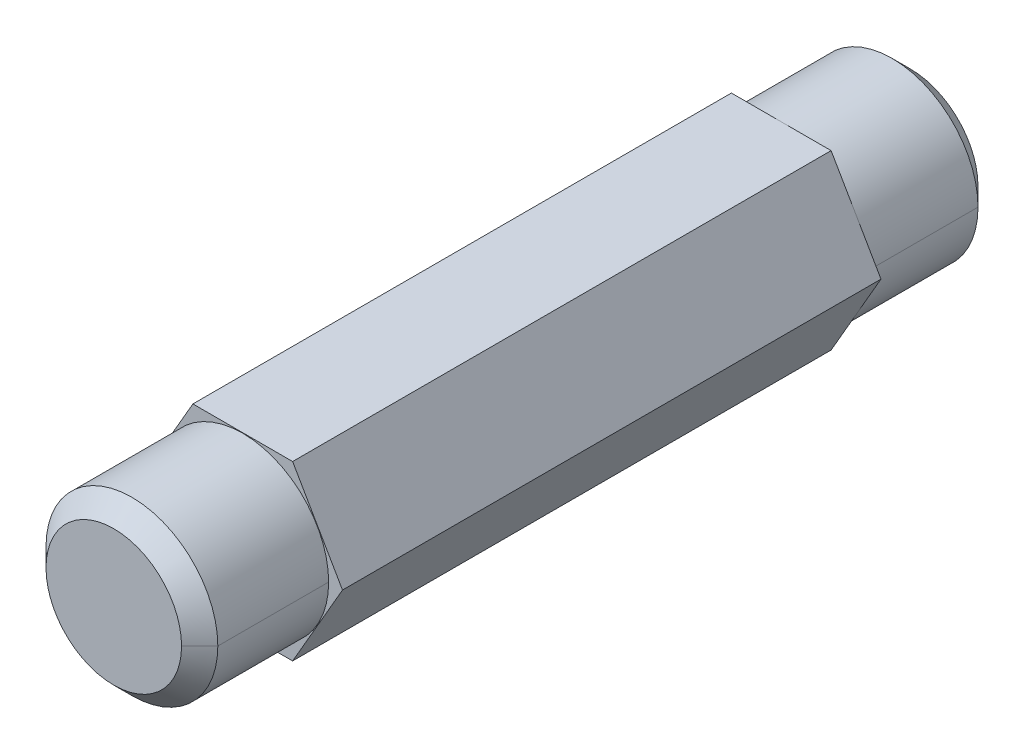
ISO-10303-21;
HEADER;
FILE_DESCRIPTION(('STEP AP214'),'2;1');
FILE_NAME('part.step','',(''),(''),'','','');
FILE_SCHEMA(('AUTOMOTIVE_DESIGN { 1 0 10303 214 1 1 1 1 }'));
ENDSEC;
DATA;
#1=APPLICATION_CONTEXT('core data for automotive mechanical design processes');
#2=APPLICATION_PROTOCOL_DEFINITION('international standard','automotive_design',2000,#1);
#3=PRODUCT_CONTEXT('',#1,'mechanical');
#4=PRODUCT('Part','Part','',(#3));
#5=PRODUCT_RELATED_PRODUCT_CATEGORY('part','',(#4));
#6=PRODUCT_DEFINITION_FORMATION('','',#4);
#7=PRODUCT_DEFINITION_CONTEXT('part definition',#1,'design');
#8=PRODUCT_DEFINITION('design','',#6,#7);
#9=PRODUCT_DEFINITION_SHAPE('','',#8);
#10=(LENGTH_UNIT() NAMED_UNIT(*) SI_UNIT(.MILLI.,.METRE.));
#11=(NAMED_UNIT(*) PLANE_ANGLE_UNIT() SI_UNIT($,.RADIAN.));
#12=(NAMED_UNIT(*) SI_UNIT($,.STERADIAN.) SOLID_ANGLE_UNIT());
#13=UNCERTAINTY_MEASURE_WITH_UNIT(LENGTH_MEASURE(1.E-05),#10,'distance_accuracy_value','');
#14=(GEOMETRIC_REPRESENTATION_CONTEXT(3) GLOBAL_UNCERTAINTY_ASSIGNED_CONTEXT((#13)) GLOBAL_UNIT_ASSIGNED_CONTEXT((#10,
#11,#12)) REPRESENTATION_CONTEXT('',''));
#15=CARTESIAN_POINT('',(0.,0.,0.));
#16=DIRECTION('',(0.,0.,1.));
#17=DIRECTION('',(1.,0.,0.));
#18=AXIS2_PLACEMENT_3D('',#15,#16,#17);
#19=CARTESIAN_POINT('',(0.,0.,21.9583));
#20=DIRECTION('',(0.,0.,-1.));
#21=DIRECTION('',(-1.,0.,0.));
#22=AXIS2_PLACEMENT_3D('',#19,#20,#21);
#23=CONICAL_SURFACE('',#22,3.7371,0.785398163397445);
#24=CARTESIAN_POINT('',(0.,0.,21.9583));
#25=DIRECTION('',(0.,0.,1.));
#26=DIRECTION('',(1.,0.,0.));
#27=AXIS2_PLACEMENT_3D('',#24,#25,#26);
#28=CIRCLE('',#27,3.7371);
#29=CARTESIAN_POINT('',(3.7371,0.,21.9583));
#30=VERTEX_POINT('',#29);
#31=CARTESIAN_POINT('',(-3.7371,0.,21.9583));
#32=VERTEX_POINT('',#31);
#33=EDGE_CURVE('E39',#30,#32,#28,.T.);
#34=ORIENTED_EDGE('',*,*,#33,.F.);
#35=DIRECTION('',(0.707106781186545,0.,-0.70710678118655));
#36=VECTOR('',#35,1.);
#37=CARTESIAN_POINT('',(3.7371,0.,21.9583));
#38=LINE('',#37,#36);
#39=CARTESIAN_POINT('',(4.7371,0.,20.9583));
#40=VERTEX_POINT('',#39);
#41=EDGE_CURVE('E11',#30,#40,#38,.T.);
#42=ORIENTED_EDGE('',*,*,#41,.T.);
#43=CARTESIAN_POINT('',(0.,0.,20.9583));
#44=DIRECTION('',(0.,0.,-1.));
#45=DIRECTION('',(1.,0.,0.));
#46=AXIS2_PLACEMENT_3D('',#43,#44,#45);
#47=CIRCLE('',#46,4.7371);
#48=CARTESIAN_POINT('',(-4.7371,0.,20.9583));
#49=VERTEX_POINT('',#48);
#50=EDGE_CURVE('E255',#49,#40,#47,.T.);
#51=ORIENTED_EDGE('',*,*,#50,.F.);
#52=DIRECTION('',(-0.707106781186545,0.,-0.70710678118655));
#53=VECTOR('',#52,1.);
#54=CARTESIAN_POINT('',(-3.7371,0.,21.9583));
#55=LINE('',#54,#53);
#56=EDGE_CURVE('E260',#32,#49,#55,.T.);
#57=ORIENTED_EDGE('',*,*,#56,.F.);
#58=EDGE_LOOP('',(#34,#42,#51,#57));
#59=FACE_BOUND('',#58,.T.);
#60=ADVANCED_FACE('F16',(#59),#23,.T.);
#61=CARTESIAN_POINT('',(0.,0.,-20.9583));
#62=DIRECTION('',(0.,0.,1.));
#63=DIRECTION('',(1.,0.,0.));
#64=AXIS2_PLACEMENT_3D('',#61,#62,#63);
#65=CONICAL_SURFACE('',#64,4.7371,0.785398163397452);
#66=CARTESIAN_POINT('',(0.,0.,-21.9583));
#67=DIRECTION('',(0.,0.,-1.));
#68=DIRECTION('',(-1.,0.,0.));
#69=AXIS2_PLACEMENT_3D('',#66,#67,#68);
#70=CIRCLE('',#69,3.7371);
#71=CARTESIAN_POINT('',(-3.7371,0.,-21.9583));
#72=VERTEX_POINT('',#71);
#73=CARTESIAN_POINT('',(3.7371,0.,-21.9583));
#74=VERTEX_POINT('',#73);
#75=EDGE_CURVE('E210',#72,#74,#70,.T.);
#76=ORIENTED_EDGE('',*,*,#75,.F.);
#77=DIRECTION('',(-0.70710678118655,0.,0.707106781186545));
#78=VECTOR('',#77,1.);
#79=CARTESIAN_POINT('',(-4.7371,0.,-20.9583));
#80=LINE('',#79,#78);
#81=CARTESIAN_POINT('',(-4.7371,0.,-20.9583));
#82=VERTEX_POINT('',#81);
#83=EDGE_CURVE('E26',#72,#82,#80,.T.);
#84=ORIENTED_EDGE('',*,*,#83,.T.);
#85=CARTESIAN_POINT('',(0.,0.,-20.9583));
#86=DIRECTION('',(0.,0.,1.));
#87=DIRECTION('',(-1.,0.,0.));
#88=AXIS2_PLACEMENT_3D('',#85,#86,#87);
#89=CIRCLE('',#88,4.7371);
#90=CARTESIAN_POINT('',(4.7371,0.,-20.9583));
#91=VERTEX_POINT('',#90);
#92=EDGE_CURVE('E166',#91,#82,#89,.T.);
#93=ORIENTED_EDGE('',*,*,#92,.F.);
#94=DIRECTION('',(0.70710678118655,0.,0.707106781186545));
#95=VECTOR('',#94,1.);
#96=CARTESIAN_POINT('',(4.7371,0.,-20.9583));
#97=LINE('',#96,#95);
#98=EDGE_CURVE('E253',#74,#91,#97,.T.);
#99=ORIENTED_EDGE('',*,*,#98,.F.);
#100=EDGE_LOOP('',(#76,#84,#93,#99));
#101=FACE_BOUND('',#100,.T.);
#102=ADVANCED_FACE('F332',(#101),#65,.T.);
#103=CARTESIAN_POINT('',(0.,0.,-21.9583));
#104=DIRECTION('',(0.,0.,1.));
#105=DIRECTION('',(1.,0.,0.));
#106=AXIS2_PLACEMENT_3D('',#103,#104,#105);
#107=CYLINDRICAL_SURFACE('',#106,4.7371);
#108=ORIENTED_EDGE('',*,*,#92,.T.);
#109=DIRECTION('',(0.,0.,1.));
#110=VECTOR('',#109,1.);
#111=CARTESIAN_POINT('',(-4.7371,0.,-21.9583));
#112=LINE('',#111,#110);
#113=CARTESIAN_POINT('',(-4.7371,0.,-14.8463));
#114=VERTEX_POINT('',#113);
#115=EDGE_CURVE('E257',#82,#114,#112,.T.);
#116=ORIENTED_EDGE('',*,*,#115,.T.);
#117=CARTESIAN_POINT('',(0.,0.,-14.8463));
#118=DIRECTION('',(0.,0.,1.));
#119=DIRECTION('',(1.,0.,0.));
#120=AXIS2_PLACEMENT_3D('',#117,#118,#119);
#121=CIRCLE('',#120,4.7371);
#122=CARTESIAN_POINT('',(4.7371,0.,-14.8463));
#123=VERTEX_POINT('',#122);
#124=EDGE_CURVE('E178',#123,#114,#121,.T.);
#125=ORIENTED_EDGE('',*,*,#124,.F.);
#126=DIRECTION('',(0.,0.,1.));
#127=VECTOR('',#126,1.);
#128=CARTESIAN_POINT('',(4.7371,0.,-21.9583));
#129=LINE('',#128,#127);
#130=EDGE_CURVE('E209',#91,#123,#129,.T.);
#131=ORIENTED_EDGE('',*,*,#130,.F.);
#132=EDGE_LOOP('',(#108,#116,#125,#131));
#133=FACE_BOUND('',#132,.T.);
#134=ADVANCED_FACE('F327',(#133),#107,.T.);
#135=CARTESIAN_POINT('',(0.,0.,21.9583));
#136=DIRECTION('',(0.,0.,-1.));
#137=DIRECTION('',(-1.,0.,0.));
#138=AXIS2_PLACEMENT_3D('',#135,#136,#137);
#139=CYLINDRICAL_SURFACE('',#138,4.7371);
#140=ORIENTED_EDGE('',*,*,#50,.T.);
#141=DIRECTION('',(0.,0.,-1.));
#142=VECTOR('',#141,1.);
#143=CARTESIAN_POINT('',(4.7371,0.,21.9583));
#144=LINE('',#143,#142);
#145=CARTESIAN_POINT('',(4.7371,0.,14.8463));
#146=VERTEX_POINT('',#145);
#147=EDGE_CURVE('E148',#40,#146,#144,.T.);
#148=ORIENTED_EDGE('',*,*,#147,.T.);
#149=CARTESIAN_POINT('',(0.,0.,14.8463));
#150=DIRECTION('',(0.,0.,1.));
#151=DIRECTION('',(1.,0.,0.));
#152=AXIS2_PLACEMENT_3D('',#149,#150,#151);
#153=CIRCLE('',#152,4.7371);
#154=CARTESIAN_POINT('',(-4.7371,0.,14.8463));
#155=VERTEX_POINT('',#154);
#156=EDGE_CURVE('E146',#146,#155,#153,.T.);
#157=ORIENTED_EDGE('',*,*,#156,.T.);
#158=DIRECTION('',(0.,0.,-1.));
#159=VECTOR('',#158,1.);
#160=CARTESIAN_POINT('',(-4.7371,0.,21.9583));
#161=LINE('',#160,#159);
#162=EDGE_CURVE('E133',#49,#155,#161,.T.);
#163=ORIENTED_EDGE('',*,*,#162,.F.);
#164=EDGE_LOOP('',(#140,#148,#157,#163));
#165=FACE_BOUND('',#164,.T.);
#166=ADVANCED_FACE('F147',(#165),#139,.T.);
#167=CARTESIAN_POINT('',(5.49926131403118,0.,14.8463));
#168=DIRECTION('',(0.,0.,1.));
#169=DIRECTION('',(1.,0.,0.));
#170=AXIS2_PLACEMENT_3D('',#167,#168,#169);
#171=PLANE('',#170);
#172=DIRECTION('',(0.5,0.866025403784439,0.));
#173=VECTOR('',#172,1.);
#174=CARTESIAN_POINT('',(2.74963065701559,-4.7625,14.8463));
#175=LINE('',#174,#173);
#176=CARTESIAN_POINT('',(2.74963065701559,-4.7625,14.8463));
#177=VERTEX_POINT('',#176);
#178=CARTESIAN_POINT('',(5.49926131403118,0.,14.8463));
#179=VERTEX_POINT('',#178);
#180=EDGE_CURVE('E151',#177,#179,#175,.T.);
#181=ORIENTED_EDGE('',*,*,#180,.T.);
#182=DIRECTION('',(-0.5,0.866025403784439,0.));
#183=VECTOR('',#182,1.);
#184=CARTESIAN_POINT('',(5.49926131403118,0.,14.8463));
#185=LINE('',#184,#183);
#186=CARTESIAN_POINT('',(2.74963065701559,4.7625,14.8463));
#187=VERTEX_POINT('',#186);
#188=EDGE_CURVE('E188',#179,#187,#185,.T.);
#189=ORIENTED_EDGE('',*,*,#188,.T.);
#190=DIRECTION('',(-1.,0.,0.));
#191=VECTOR('',#190,1.);
#192=CARTESIAN_POINT('',(2.74963065701559,4.7625,14.8463));
#193=LINE('',#192,#191);
#194=CARTESIAN_POINT('',(-2.7496306570156,4.7625,14.8463));
#195=VERTEX_POINT('',#194);
#196=EDGE_CURVE('E183',#187,#195,#193,.T.);
#197=ORIENTED_EDGE('',*,*,#196,.T.);
#198=DIRECTION('',(-0.5,-0.866025403784439,0.));
#199=VECTOR('',#198,1.);
#200=CARTESIAN_POINT('',(-2.7496306570156,4.7625,14.8463));
#201=LINE('',#200,#199);
#202=CARTESIAN_POINT('',(-5.49926131403119,0.,14.8463));
#203=VERTEX_POINT('',#202);
#204=EDGE_CURVE('E179',#195,#203,#201,.T.);
#205=ORIENTED_EDGE('',*,*,#204,.T.);
#206=DIRECTION('',(0.5,-0.866025403784439,0.));
#207=VECTOR('',#206,1.);
#208=CARTESIAN_POINT('',(-5.49926131403119,0.,14.8463));
#209=LINE('',#208,#207);
#210=CARTESIAN_POINT('',(-2.7496306570156,-4.7625,14.8463));
#211=VERTEX_POINT('',#210);
#212=EDGE_CURVE('E184',#203,#211,#209,.T.);
#213=ORIENTED_EDGE('',*,*,#212,.T.);
#214=DIRECTION('',(1.,0.,0.));
#215=VECTOR('',#214,1.);
#216=CARTESIAN_POINT('',(-2.7496306570156,-4.7625,14.8463));
#217=LINE('',#216,#215);
#218=EDGE_CURVE('E195',#211,#177,#217,.T.);
#219=ORIENTED_EDGE('',*,*,#218,.T.);
#220=EDGE_LOOP('',(#181,#189,#197,#205,#213,#219));
#221=FACE_BOUND('',#220,.T.);
#222=CARTESIAN_POINT('',(0.,0.,14.8463));
#223=DIRECTION('',(0.,0.,1.));
#224=DIRECTION('',(1.,0.,0.));
#225=AXIS2_PLACEMENT_3D('',#222,#223,#224);
#226=CIRCLE('',#225,4.7371);
#227=EDGE_CURVE('E137',#155,#146,#226,.T.);
#228=ORIENTED_EDGE('',*,*,#227,.F.);
#229=ORIENTED_EDGE('',*,*,#156,.F.);
#230=EDGE_LOOP('',(#228,#229));
#231=FACE_BOUND('',#230,.T.);
#232=ADVANCED_FACE('F153',(#221,#231),#171,.T.);
#233=CARTESIAN_POINT('',(2.74963065701559,-4.7625,14.8463));
#234=DIRECTION('',(-0.866025403784439,0.5,0.));
#235=DIRECTION('',(0.,0.,1.));
#236=AXIS2_PLACEMENT_3D('',#233,#234,#235);
#237=PLANE('',#236);
#238=DIRECTION('',(0.5,0.866025403784439,0.));
#239=VECTOR('',#238,1.);
#240=CARTESIAN_POINT('',(2.74963065701559,-4.7625,-14.8463));
#241=LINE('',#240,#239);
#242=CARTESIAN_POINT('',(2.74963065701559,-4.7625,-14.8463));
#243=VERTEX_POINT('',#242);
#244=CARTESIAN_POINT('',(5.49926131403118,0.,-14.8463));
#245=VERTEX_POINT('',#244);
#246=EDGE_CURVE('E198',#243,#245,#241,.T.);
#247=ORIENTED_EDGE('',*,*,#246,.T.);
#248=DIRECTION('',(0.,0.,-1.));
#249=VECTOR('',#248,1.);
#250=CARTESIAN_POINT('',(5.49926131403118,0.,14.8463));
#251=LINE('',#250,#249);
#252=EDGE_CURVE('E221',#179,#245,#251,.T.);
#253=ORIENTED_EDGE('',*,*,#252,.F.);
#254=ORIENTED_EDGE('',*,*,#180,.F.);
#255=DIRECTION('',(0.,0.,-1.));
#256=VECTOR('',#255,1.);
#257=CARTESIAN_POINT('',(2.74963065701559,-4.7625,14.8463));
#258=LINE('',#257,#256);
#259=EDGE_CURVE('E220',#177,#243,#258,.T.);
#260=ORIENTED_EDGE('',*,*,#259,.T.);
#261=EDGE_LOOP('',(#247,#253,#254,#260));
#262=FACE_BOUND('',#261,.T.);
#263=ADVANCED_FACE('F365',(#262),#237,.F.);
#264=CARTESIAN_POINT('',(5.49926131403118,0.,14.8463));
#265=DIRECTION('',(-0.866025403784439,-0.5,0.));
#266=DIRECTION('',(-0.5,0.866025403784439,0.));
#267=AXIS2_PLACEMENT_3D('',#264,#265,#266);
#268=PLANE('',#267);
#269=DIRECTION('',(-0.5,0.866025403784439,0.));
#270=VECTOR('',#269,1.);
#271=CARTESIAN_POINT('',(5.49926131403118,0.,-14.8463));
#272=LINE('',#271,#270);
#273=CARTESIAN_POINT('',(2.74963065701559,4.7625,-14.8463));
#274=VERTEX_POINT('',#273);
#275=EDGE_CURVE('E216',#245,#274,#272,.T.);
#276=ORIENTED_EDGE('',*,*,#275,.T.);
#277=DIRECTION('',(0.,0.,-1.));
#278=VECTOR('',#277,1.);
#279=CARTESIAN_POINT('',(2.74963065701559,4.7625,14.8463));
#280=LINE('',#279,#278);
#281=EDGE_CURVE('E202',#187,#274,#280,.T.);
#282=ORIENTED_EDGE('',*,*,#281,.F.);
#283=ORIENTED_EDGE('',*,*,#188,.F.);
#284=ORIENTED_EDGE('',*,*,#252,.T.);
#285=EDGE_LOOP('',(#276,#282,#283,#284));
#286=FACE_BOUND('',#285,.T.);
#287=ADVANCED_FACE('F312',(#286),#268,.F.);
#288=CARTESIAN_POINT('',(2.74963065701559,4.7625,14.8463));
#289=DIRECTION('',(0.,-1.,0.));
#290=DIRECTION('',(0.,0.,-1.));
#291=AXIS2_PLACEMENT_3D('',#288,#289,#290);
#292=PLANE('',#291);
#293=DIRECTION('',(-1.,0.,0.));
#294=VECTOR('',#293,1.);
#295=CARTESIAN_POINT('',(2.74963065701559,4.7625,-14.8463));
#296=LINE('',#295,#294);
#297=CARTESIAN_POINT('',(-2.7496306570156,4.7625,-14.8463));
#298=VERTEX_POINT('',#297);
#299=EDGE_CURVE('E230',#274,#298,#296,.T.);
#300=ORIENTED_EDGE('',*,*,#299,.T.);
#301=DIRECTION('',(0.,0.,-1.));
#302=VECTOR('',#301,1.);
#303=CARTESIAN_POINT('',(-2.7496306570156,4.7625,14.8463));
#304=LINE('',#303,#302);
#305=EDGE_CURVE('E170',#195,#298,#304,.T.);
#306=ORIENTED_EDGE('',*,*,#305,.F.);
#307=ORIENTED_EDGE('',*,*,#196,.F.);
#308=ORIENTED_EDGE('',*,*,#281,.T.);
#309=EDGE_LOOP('',(#300,#306,#307,#308));
#310=FACE_BOUND('',#309,.T.);
#311=ADVANCED_FACE('F295',(#310),#292,.F.);
#312=CARTESIAN_POINT('',(-2.7496306570156,4.7625,14.8463));
#313=DIRECTION('',(0.866025403784439,-0.5,0.));
#314=DIRECTION('',(0.,0.,-1.));
#315=AXIS2_PLACEMENT_3D('',#312,#313,#314);
#316=PLANE('',#315);
#317=DIRECTION('',(-0.5,-0.866025403784439,0.));
#318=VECTOR('',#317,1.);
#319=CARTESIAN_POINT('',(-2.7496306570156,4.7625,-14.8463));
#320=LINE('',#319,#318);
#321=CARTESIAN_POINT('',(-5.49926131403119,0.,-14.8463));
#322=VERTEX_POINT('',#321);
#323=EDGE_CURVE('E191',#298,#322,#320,.T.);
#324=ORIENTED_EDGE('',*,*,#323,.T.);
#325=DIRECTION('',(0.,0.,-1.));
#326=VECTOR('',#325,1.);
#327=CARTESIAN_POINT('',(-5.49926131403119,0.,14.8463));
#328=LINE('',#327,#326);
#329=EDGE_CURVE('E171',#203,#322,#328,.T.);
#330=ORIENTED_EDGE('',*,*,#329,.F.);
#331=ORIENTED_EDGE('',*,*,#204,.F.);
#332=ORIENTED_EDGE('',*,*,#305,.T.);
#333=EDGE_LOOP('',(#324,#330,#331,#332));
#334=FACE_BOUND('',#333,.T.);
#335=ADVANCED_FACE('F306',(#334),#316,.F.);
#336=CARTESIAN_POINT('',(-5.49926131403119,0.,14.8463));
#337=DIRECTION('',(0.866025403784439,0.5,0.));
#338=DIRECTION('',(0.,0.,-1.));
#339=AXIS2_PLACEMENT_3D('',#336,#337,#338);
#340=PLANE('',#339);
#341=DIRECTION('',(0.5,-0.866025403784439,0.));
#342=VECTOR('',#341,1.);
#343=CARTESIAN_POINT('',(-5.49926131403119,0.,-14.8463));
#344=LINE('',#343,#342);
#345=CARTESIAN_POINT('',(-2.7496306570156,-4.7625,-14.8463));
#346=VERTEX_POINT('',#345);
#347=EDGE_CURVE('E167',#322,#346,#344,.T.);
#348=ORIENTED_EDGE('',*,*,#347,.T.);
#349=DIRECTION('',(0.,0.,-1.));
#350=VECTOR('',#349,1.);
#351=CARTESIAN_POINT('',(-2.7496306570156,-4.7625,14.8463));
#352=LINE('',#351,#350);
#353=EDGE_CURVE('E194',#211,#346,#352,.T.);
#354=ORIENTED_EDGE('',*,*,#353,.F.);
#355=ORIENTED_EDGE('',*,*,#212,.F.);
#356=ORIENTED_EDGE('',*,*,#329,.T.);
#357=EDGE_LOOP('',(#348,#354,#355,#356));
#358=FACE_BOUND('',#357,.T.);
#359=ADVANCED_FACE('F424',(#358),#340,.F.);
#360=CARTESIAN_POINT('',(-2.7496306570156,-4.7625,14.8463));
#361=DIRECTION('',(0.,1.,0.));
#362=DIRECTION('',(1.,0.,0.));
#363=AXIS2_PLACEMENT_3D('',#360,#361,#362);
#364=PLANE('',#363);
#365=DIRECTION('',(1.,0.,0.));
#366=VECTOR('',#365,1.);
#367=CARTESIAN_POINT('',(-2.7496306570156,-4.7625,-14.8463));
#368=LINE('',#367,#366);
#369=EDGE_CURVE('E19',#346,#243,#368,.T.);
#370=ORIENTED_EDGE('',*,*,#369,.T.);
#371=ORIENTED_EDGE('',*,*,#259,.F.);
#372=ORIENTED_EDGE('',*,*,#218,.F.);
#373=ORIENTED_EDGE('',*,*,#353,.T.);
#374=EDGE_LOOP('',(#370,#371,#372,#373));
#375=FACE_BOUND('',#374,.T.);
#376=ADVANCED_FACE('F317',(#375),#364,.F.);
#377=CARTESIAN_POINT('',(5.49926131403118,0.,-14.8463));
#378=DIRECTION('',(0.,0.,1.));
#379=DIRECTION('',(1.,0.,0.));
#380=AXIS2_PLACEMENT_3D('',#377,#378,#379);
#381=PLANE('',#380);
#382=ORIENTED_EDGE('',*,*,#246,.F.);
#383=ORIENTED_EDGE('',*,*,#369,.F.);
#384=ORIENTED_EDGE('',*,*,#347,.F.);
#385=ORIENTED_EDGE('',*,*,#323,.F.);
#386=ORIENTED_EDGE('',*,*,#299,.F.);
#387=ORIENTED_EDGE('',*,*,#275,.F.);
#388=EDGE_LOOP('',(#382,#383,#384,#385,#386,#387));
#389=FACE_BOUND('',#388,.T.);
#390=ORIENTED_EDGE('',*,*,#124,.T.);
#391=CARTESIAN_POINT('',(0.,0.,-14.8463));
#392=DIRECTION('',(0.,0.,1.));
#393=DIRECTION('',(1.,0.,0.));
#394=AXIS2_PLACEMENT_3D('',#391,#392,#393);
#395=CIRCLE('',#394,4.7371);
#396=EDGE_CURVE('E173',#114,#123,#395,.T.);
#397=ORIENTED_EDGE('',*,*,#396,.T.);
#398=EDGE_LOOP('',(#390,#397));
#399=FACE_BOUND('',#398,.T.);
#400=ADVANCED_FACE('F301',(#389,#399),#381,.F.);
#401=CARTESIAN_POINT('',(0.,0.,21.9583));
#402=DIRECTION('',(0.,0.,-1.));
#403=DIRECTION('',(-1.,0.,0.));
#404=AXIS2_PLACEMENT_3D('',#401,#402,#403);
#405=CYLINDRICAL_SURFACE('',#404,4.7371);
#406=ORIENTED_EDGE('',*,*,#147,.F.);
#407=CARTESIAN_POINT('',(0.,0.,20.9583));
#408=DIRECTION('',(0.,0.,-1.));
#409=DIRECTION('',(1.,0.,0.));
#410=AXIS2_PLACEMENT_3D('',#407,#408,#409);
#411=CIRCLE('',#410,4.7371);
#412=EDGE_CURVE('E139',#40,#49,#411,.T.);
#413=ORIENTED_EDGE('',*,*,#412,.T.);
#414=ORIENTED_EDGE('',*,*,#162,.T.);
#415=ORIENTED_EDGE('',*,*,#227,.T.);
#416=EDGE_LOOP('',(#406,#413,#414,#415));
#417=FACE_BOUND('',#416,.T.);
#418=ADVANCED_FACE('F135',(#417),#405,.T.);
#419=CARTESIAN_POINT('',(0.,0.,21.9583));
#420=DIRECTION('',(0.,0.,1.));
#421=DIRECTION('',(1.,0.,0.));
#422=AXIS2_PLACEMENT_3D('',#419,#420,#421);
#423=PLANE('',#422);
#424=CARTESIAN_POINT('',(0.,0.,21.9583));
#425=DIRECTION('',(0.,0.,1.));
#426=DIRECTION('',(1.,0.,0.));
#427=AXIS2_PLACEMENT_3D('',#424,#425,#426);
#428=CIRCLE('',#427,3.7371);
#429=EDGE_CURVE('E155',#32,#30,#428,.T.);
#430=ORIENTED_EDGE('',*,*,#429,.T.);
#431=ORIENTED_EDGE('',*,*,#33,.T.);
#432=EDGE_LOOP('',(#430,#431));
#433=FACE_BOUND('',#432,.T.);
#434=ADVANCED_FACE('F404',(#433),#423,.T.);
#435=CARTESIAN_POINT('',(0.,0.,-21.9583));
#436=DIRECTION('',(0.,0.,1.));
#437=DIRECTION('',(1.,0.,0.));
#438=AXIS2_PLACEMENT_3D('',#435,#436,#437);
#439=CYLINDRICAL_SURFACE('',#438,4.7371);
#440=ORIENTED_EDGE('',*,*,#115,.F.);
#441=CARTESIAN_POINT('',(0.,0.,-20.9583));
#442=DIRECTION('',(0.,0.,1.));
#443=DIRECTION('',(-1.,0.,0.));
#444=AXIS2_PLACEMENT_3D('',#441,#442,#443);
#445=CIRCLE('',#444,4.7371);
#446=EDGE_CURVE('E233',#82,#91,#445,.T.);
#447=ORIENTED_EDGE('',*,*,#446,.T.);
#448=ORIENTED_EDGE('',*,*,#130,.T.);
#449=ORIENTED_EDGE('',*,*,#396,.F.);
#450=EDGE_LOOP('',(#440,#447,#448,#449));
#451=FACE_BOUND('',#450,.T.);
#452=ADVANCED_FACE('F355',(#451),#439,.T.);
#453=CARTESIAN_POINT('',(0.,0.,-21.9583));
#454=DIRECTION('',(0.,0.,-1.));
#455=DIRECTION('',(0.,-1.,0.));
#456=AXIS2_PLACEMENT_3D('',#453,#454,#455);
#457=PLANE('',#456);
#458=CARTESIAN_POINT('',(0.,0.,-21.9583));
#459=DIRECTION('',(0.,0.,-1.));
#460=DIRECTION('',(-1.,0.,0.));
#461=AXIS2_PLACEMENT_3D('',#458,#459,#460);
#462=CIRCLE('',#461,3.7371);
#463=EDGE_CURVE('E205',#74,#72,#462,.T.);
#464=ORIENTED_EDGE('',*,*,#463,.T.);
#465=ORIENTED_EDGE('',*,*,#75,.T.);
#466=EDGE_LOOP('',(#464,#465));
#467=FACE_BOUND('',#466,.T.);
#468=ADVANCED_FACE('F350',(#467),#457,.T.);
#469=CARTESIAN_POINT('',(0.,0.,-20.9583));
#470=DIRECTION('',(0.,0.,1.));
#471=DIRECTION('',(1.,0.,0.));
#472=AXIS2_PLACEMENT_3D('',#469,#470,#471);
#473=CONICAL_SURFACE('',#472,4.7371,0.785398163397452);
#474=ORIENTED_EDGE('',*,*,#83,.F.);
#475=ORIENTED_EDGE('',*,*,#463,.F.);
#476=ORIENTED_EDGE('',*,*,#98,.T.);
#477=ORIENTED_EDGE('',*,*,#446,.F.);
#478=EDGE_LOOP('',(#474,#475,#476,#477));
#479=FACE_BOUND('',#478,.T.);
#480=ADVANCED_FACE('F354',(#479),#473,.T.);
#481=CARTESIAN_POINT('',(0.,0.,21.9583));
#482=DIRECTION('',(0.,0.,-1.));
#483=DIRECTION('',(-1.,0.,0.));
#484=AXIS2_PLACEMENT_3D('',#481,#482,#483);
#485=CONICAL_SURFACE('',#484,3.7371,0.785398163397445);
#486=ORIENTED_EDGE('',*,*,#41,.F.);
#487=ORIENTED_EDGE('',*,*,#429,.F.);
#488=ORIENTED_EDGE('',*,*,#56,.T.);
#489=ORIENTED_EDGE('',*,*,#412,.F.);
#490=EDGE_LOOP('',(#486,#487,#488,#489));
#491=FACE_BOUND('',#490,.T.);
#492=ADVANCED_FACE('F372',(#491),#485,.T.);
#493=CLOSED_SHELL('',(#60,#102,#134,#166,#232,#263,#287,#311,#335,#359,#376,#400,#418,#434,#452,
#468,#480,#492));
#494=MANIFOLD_SOLID_BREP('B1',#493);
#495=ADVANCED_BREP_SHAPE_REPRESENTATION('',(#18,#494),#14);
#496=SHAPE_DEFINITION_REPRESENTATION(#9,#495);
ENDSEC;
END-ISO-10303-21;
